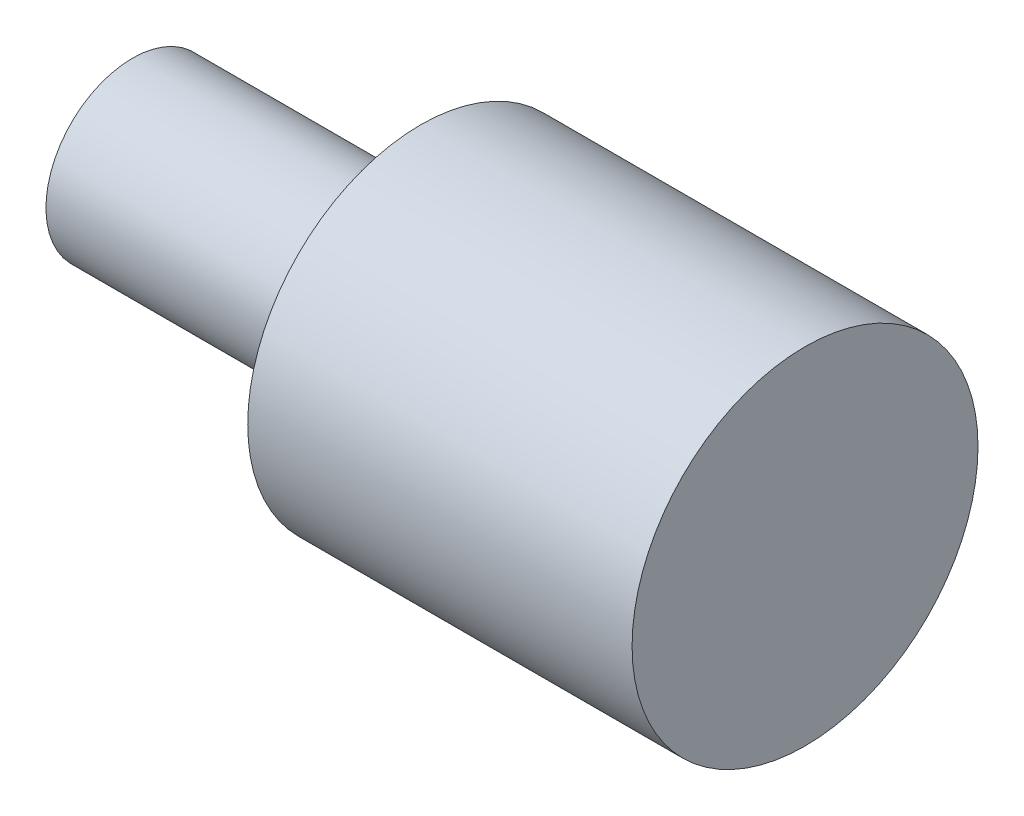
ISO-10303-21;
HEADER;
FILE_DESCRIPTION(('STEP AP214'),'2;1');
FILE_NAME('part.step','',(''),(''),'','','');
FILE_SCHEMA(('AUTOMOTIVE_DESIGN { 1 0 10303 214 1 1 1 1 }'));
ENDSEC;
DATA;
#1=APPLICATION_CONTEXT('core data for automotive mechanical design processes');
#2=APPLICATION_PROTOCOL_DEFINITION('international standard','automotive_design',2000,#1);
#3=PRODUCT_CONTEXT('',#1,'mechanical');
#4=PRODUCT('Part','Part','',(#3));
#5=PRODUCT_RELATED_PRODUCT_CATEGORY('part','',(#4));
#6=PRODUCT_DEFINITION_FORMATION('','',#4);
#7=PRODUCT_DEFINITION_CONTEXT('part definition',#1,'design');
#8=PRODUCT_DEFINITION('design','',#6,#7);
#9=PRODUCT_DEFINITION_SHAPE('','',#8);
#10=(LENGTH_UNIT() NAMED_UNIT(*) SI_UNIT(.MILLI.,.METRE.));
#11=(NAMED_UNIT(*) PLANE_ANGLE_UNIT() SI_UNIT($,.RADIAN.));
#12=(NAMED_UNIT(*) SI_UNIT($,.STERADIAN.) SOLID_ANGLE_UNIT());
#13=UNCERTAINTY_MEASURE_WITH_UNIT(LENGTH_MEASURE(1.E-05),#10,'distance_accuracy_value','');
#14=(GEOMETRIC_REPRESENTATION_CONTEXT(3) GLOBAL_UNCERTAINTY_ASSIGNED_CONTEXT((#13)) GLOBAL_UNIT_ASSIGNED_CONTEXT((#10,
#11,#12)) REPRESENTATION_CONTEXT('',''));
#15=CARTESIAN_POINT('',(0.,0.,0.));
#16=DIRECTION('',(0.,0.,1.));
#17=DIRECTION('',(1.,0.,0.));
#18=AXIS2_PLACEMENT_3D('',#15,#16,#17);
#19=CARTESIAN_POINT('',(0.,0.,0.));
#20=DIRECTION('',(-1.,0.,0.));
#21=DIRECTION('',(0.,-1.,0.));
#22=AXIS2_PLACEMENT_3D('',#19,#20,#21);
#23=PLANE('',#22);
#24=CARTESIAN_POINT('',(0.,0.,0.));
#25=DIRECTION('',(1.,0.,0.));
#26=DIRECTION('',(0.,1.,0.));
#27=AXIS2_PLACEMENT_3D('',#24,#25,#26);
#28=CIRCLE('',#27,0.9);
#29=CARTESIAN_POINT('',(0.,0.9,0.));
#30=VERTEX_POINT('',#29);
#31=EDGE_CURVE('E10',#30,#30,#28,.T.);
#32=ORIENTED_EDGE('',*,*,#31,.F.);
#33=EDGE_LOOP('',(#32));
#34=FACE_BOUND('',#33,.T.);
#35=ADVANCED_FACE('F29',(#34),#23,.T.);
#36=CARTESIAN_POINT('',(7.,0.,0.));
#37=DIRECTION('',(1.,0.,0.));
#38=DIRECTION('',(0.,1.,0.));
#39=AXIS2_PLACEMENT_3D('',#36,#37,#38);
#40=CYLINDRICAL_SURFACE('',#39,0.9);
#41=ORIENTED_EDGE('',*,*,#31,.T.);
#42=EDGE_LOOP('',(#41));
#43=FACE_BOUND('',#42,.T.);
#44=CARTESIAN_POINT('',(3.,0.,0.));
#45=DIRECTION('',(1.,0.,0.));
#46=DIRECTION('',(0.,1.,0.));
#47=AXIS2_PLACEMENT_3D('',#44,#45,#46);
#48=CIRCLE('',#47,0.9);
#49=CARTESIAN_POINT('',(3.,0.9,0.));
#50=VERTEX_POINT('',#49);
#51=EDGE_CURVE('E35',#50,#50,#48,.T.);
#52=ORIENTED_EDGE('',*,*,#51,.F.);
#53=EDGE_LOOP('',(#52));
#54=FACE_BOUND('',#53,.T.);
#55=ADVANCED_FACE('F61',(#43,#54),#40,.T.);
#56=CARTESIAN_POINT('',(3.,0.9,0.));
#57=DIRECTION('',(-1.,0.,0.));
#58=DIRECTION('',(0.,-1.,0.));
#59=AXIS2_PLACEMENT_3D('',#56,#57,#58);
#60=PLANE('',#59);
#61=ORIENTED_EDGE('',*,*,#51,.T.);
#62=EDGE_LOOP('',(#61));
#63=FACE_BOUND('',#62,.T.);
#64=CARTESIAN_POINT('',(3.,0.,0.));
#65=DIRECTION('',(1.,0.,0.));
#66=DIRECTION('',(0.,1.,0.));
#67=AXIS2_PLACEMENT_3D('',#64,#65,#66);
#68=CIRCLE('',#67,1.8);
#69=CARTESIAN_POINT('',(3.,1.8,0.));
#70=VERTEX_POINT('',#69);
#71=EDGE_CURVE('E39',#70,#70,#68,.T.);
#72=ORIENTED_EDGE('',*,*,#71,.F.);
#73=EDGE_LOOP('',(#72));
#74=FACE_BOUND('',#73,.T.);
#75=ADVANCED_FACE('F53',(#63,#74),#60,.T.);
#76=CARTESIAN_POINT('',(7.,0.,0.));
#77=DIRECTION('',(1.,0.,0.));
#78=DIRECTION('',(0.,1.,0.));
#79=AXIS2_PLACEMENT_3D('',#76,#77,#78);
#80=CYLINDRICAL_SURFACE('',#79,1.8);
#81=ORIENTED_EDGE('',*,*,#71,.T.);
#82=EDGE_LOOP('',(#81));
#83=FACE_BOUND('',#82,.T.);
#84=CARTESIAN_POINT('',(7.,0.,0.));
#85=DIRECTION('',(1.,0.,0.));
#86=DIRECTION('',(0.,1.,0.));
#87=AXIS2_PLACEMENT_3D('',#84,#85,#86);
#88=CIRCLE('',#87,1.8);
#89=CARTESIAN_POINT('',(7.,1.8,0.));
#90=VERTEX_POINT('',#89);
#91=EDGE_CURVE('E43',#90,#90,#88,.T.);
#92=ORIENTED_EDGE('',*,*,#91,.F.);
#93=EDGE_LOOP('',(#92));
#94=FACE_BOUND('',#93,.T.);
#95=ADVANCED_FACE('F51',(#83,#94),#80,.T.);
#96=CARTESIAN_POINT('',(7.,1.8,0.));
#97=DIRECTION('',(1.,0.,0.));
#98=DIRECTION('',(0.,1.,0.));
#99=AXIS2_PLACEMENT_3D('',#96,#97,#98);
#100=PLANE('',#99);
#101=ORIENTED_EDGE('',*,*,#91,.T.);
#102=EDGE_LOOP('',(#101));
#103=FACE_BOUND('',#102,.T.);
#104=ADVANCED_FACE('F49',(#103),#100,.T.);
#105=CLOSED_SHELL('',(#35,#55,#75,#95,#104));
#106=MANIFOLD_SOLID_BREP('B2',#105);
#107=ADVANCED_BREP_SHAPE_REPRESENTATION('',(#18,#106),#14);
#108=SHAPE_DEFINITION_REPRESENTATION(#9,#107);
ENDSEC;
END-ISO-10303-21;
